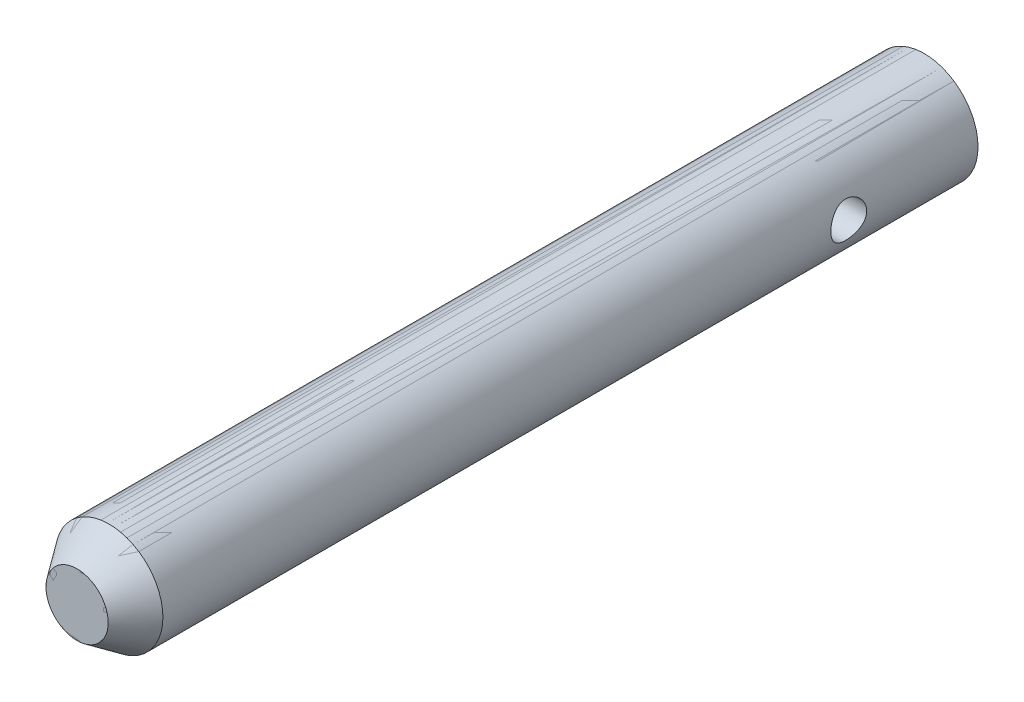
ISO-10303-21;
HEADER;
FILE_DESCRIPTION(('STEP AP214'),'2;1');
FILE_NAME('part.step','',(''),(''),'','','');
FILE_SCHEMA(('AUTOMOTIVE_DESIGN { 1 0 10303 214 1 1 1 1 }'));
ENDSEC;
DATA;
#1=APPLICATION_CONTEXT('core data for automotive mechanical design processes');
#2=APPLICATION_PROTOCOL_DEFINITION('international standard','automotive_design',2000,#1);
#3=PRODUCT_CONTEXT('',#1,'mechanical');
#4=PRODUCT('Part','Part','',(#3));
#5=PRODUCT_RELATED_PRODUCT_CATEGORY('part','',(#4));
#6=PRODUCT_DEFINITION_FORMATION('','',#4);
#7=PRODUCT_DEFINITION_CONTEXT('part definition',#1,'design');
#8=PRODUCT_DEFINITION('design','',#6,#7);
#9=PRODUCT_DEFINITION_SHAPE('','',#8);
#10=(LENGTH_UNIT() NAMED_UNIT(*) SI_UNIT(.MILLI.,.METRE.));
#11=(NAMED_UNIT(*) PLANE_ANGLE_UNIT() SI_UNIT($,.RADIAN.));
#12=(NAMED_UNIT(*) SI_UNIT($,.STERADIAN.) SOLID_ANGLE_UNIT());
#13=UNCERTAINTY_MEASURE_WITH_UNIT(LENGTH_MEASURE(1.E-05),#10,'distance_accuracy_value','');
#14=(GEOMETRIC_REPRESENTATION_CONTEXT(3) GLOBAL_UNCERTAINTY_ASSIGNED_CONTEXT((#13)) GLOBAL_UNIT_ASSIGNED_CONTEXT((#10,
#11,#12)) REPRESENTATION_CONTEXT('',''));
#15=CARTESIAN_POINT('',(0.,0.,0.));
#16=DIRECTION('',(0.,0.,1.));
#17=DIRECTION('',(1.,0.,0.));
#18=AXIS2_PLACEMENT_3D('',#15,#16,#17);
#19=CARTESIAN_POINT('',(0.,0.,118.));
#20=DIRECTION('',(0.,0.,-1.));
#21=DIRECTION('',(-1.,0.,0.));
#22=AXIS2_PLACEMENT_3D('',#19,#20,#21);
#23=CYLINDRICAL_SURFACE('',#22,7.5);
#24=CARTESIAN_POINT('',(0.,0.,113.540736));
#25=DIRECTION('',(0.,0.,1.));
#26=DIRECTION('',(1.,0.,0.));
#27=AXIS2_PLACEMENT_3D('',#24,#25,#26);
#28=CIRCLE('',#27,7.5);
#29=CARTESIAN_POINT('',(7.5,0.,113.540736));
#30=VERTEX_POINT('',#29);
#31=EDGE_CURVE('P0_E65',#30,#30,#28,.T.);
#32=ORIENTED_EDGE('',*,*,#31,.F.);
#33=EDGE_LOOP('',(#32));
#34=FACE_BOUND('',#33,.T.);
#35=CARTESIAN_POINT('',(0.,0.,0.));
#36=DIRECTION('',(0.,0.,-1.));
#37=DIRECTION('',(1.,0.,0.));
#38=AXIS2_PLACEMENT_3D('',#35,#36,#37);
#39=CIRCLE('',#38,7.5);
#40=CARTESIAN_POINT('',(7.5,0.,0.));
#41=VERTEX_POINT('',#40);
#42=EDGE_CURVE('P0_E10',#41,#41,#39,.T.);
#43=ORIENTED_EDGE('',*,*,#42,.F.);
#44=EDGE_LOOP('',(#43));
#45=FACE_BOUND('',#44,.T.);
#46=CARTESIAN_POINT('',(7.5,0.,20.5));
#47=CARTESIAN_POINT('',(7.5000003825236,-0.136408407216808,20.5000006343291));
#48=CARTESIAN_POINT('',(7.49624423768862,-0.272812986346374,20.488799334682));
#49=CARTESIAN_POINT('',(7.48163025508202,-0.54160440218243,20.444427227957));
#50=CARTESIAN_POINT('',(7.47077168005382,-0.673990820297045,20.4112541401277));
#51=CARTESIAN_POINT('',(7.44313269766107,-0.930831973754439,20.3242018915399));
#52=CARTESIAN_POINT('',(7.42636219327133,-1.05529956471508,20.2703573438518));
#53=CARTESIAN_POINT('',(7.38861114293355,-1.29343734201331,20.1436470679041));
#54=CARTESIAN_POINT('',(7.36762976669445,-1.40710539239677,20.0707775874935));
#55=CARTESIAN_POINT('',(7.32285236107513,-1.62435418755567,19.9054354878531));
#56=CARTESIAN_POINT('',(7.29898891159462,-1.72750925074576,19.8124219143488));
#57=CARTESIAN_POINT('',(7.25150786957804,-1.9170817317552,19.6105821132336));
#58=CARTESIAN_POINT('',(7.22789033226373,-2.00349546372365,19.5017524126787));
#59=CARTESIAN_POINT('',(7.18283331193184,-2.15956235556965,19.2675372120089));
#60=CARTESIAN_POINT('',(7.1614759818922,-2.22866214555258,19.1417656506697));
#61=CARTESIAN_POINT('',(7.12438263546503,-2.3445471846943,18.8795597638536));
#62=CARTESIAN_POINT('',(7.10864490401864,-2.39133924346691,18.7431287070931));
#63=CARTESIAN_POINT('',(7.08528258173443,-2.45968365377291,18.4683169462582));
#64=CARTESIAN_POINT('',(7.07740239424028,-2.48203362067942,18.3301569787773));
#65=CARTESIAN_POINT('',(7.06989141573769,-2.50335280833619,18.0518406146103));
#66=CARTESIAN_POINT('',(7.07025807556825,-2.50232925401179,17.911684848227));
#67=CARTESIAN_POINT('',(7.07897537520451,-2.47754975925855,17.6401584238899));
#68=CARTESIAN_POINT('',(7.08696039668832,-2.45483478291749,17.5086789927025));
#69=CARTESIAN_POINT('',(7.10941644311377,-2.38901540712354,17.2515164509829));
#70=CARTESIAN_POINT('',(7.12388824460269,-2.34590856647967,17.1258340364123));
#71=CARTESIAN_POINT('',(7.15794777828122,-2.23984764515053,16.8814681260213));
#72=CARTESIAN_POINT('',(7.17761414482793,-2.17658512176816,16.7629299363262));
#73=CARTESIAN_POINT('',(7.21981396439316,-2.03222276575785,16.5378227293007));
#74=CARTESIAN_POINT('',(7.24234824476159,-1.95111778091001,16.4312571826665));
#75=CARTESIAN_POINT('',(7.28918322919352,-1.76837333170559,16.2272710045981));
#76=CARTESIAN_POINT('',(7.31351473387107,-1.66588287519078,16.1306182637273));
#77=CARTESIAN_POINT('',(7.36017345967592,-1.44584892492516,15.9556718333415));
#78=CARTESIAN_POINT('',(7.38250048845169,-1.32830398915203,15.8773799045888));
#79=CARTESIAN_POINT('',(7.42292769844484,-1.07986903261567,15.7407592494124));
#80=CARTESIAN_POINT('',(7.44098375020098,-0.948858191040844,15.6826362716482));
#81=CARTESIAN_POINT('',(7.47051417861087,-0.678172708411273,15.5894920651107));
#82=CARTESIAN_POINT('',(7.48199084137198,-0.538501095387385,15.5544628114414));
#83=CARTESIAN_POINT('',(7.49669067678601,-0.260959573823259,15.5098608349441));
#84=CARTESIAN_POINT('',(7.5002500458432,-0.123273999662115,15.4992504770681));
#85=CARTESIAN_POINT('',(7.49972256737068,0.151937674900593,15.5008316839962));
#86=CARTESIAN_POINT('',(7.49563701048405,0.289463798299126,15.5130193999497));
#87=CARTESIAN_POINT('',(7.4805006179276,0.55629966576064,15.5590297693399));
#88=CARTESIAN_POINT('',(7.46965496777981,0.685732017087109,15.5922155151237));
#89=CARTESIAN_POINT('',(7.44229617075175,0.937139896448935,15.6784836111668));
#90=CARTESIAN_POINT('',(7.42578230116688,1.05911447127152,15.7315684986695));
#91=CARTESIAN_POINT('',(7.38822328218224,1.29572074098318,15.857676079602));
#92=CARTESIAN_POINT('',(7.36707036889465,1.41007489804287,15.9311864832079));
#93=CARTESIAN_POINT('',(7.32263134790656,1.62516207533897,16.0954853750337));
#94=CARTESIAN_POINT('',(7.29934458984569,1.72589091948895,16.1862791400794));
#95=CARTESIAN_POINT('',(7.25192119951112,1.91563126951575,16.3874468775165));
#96=CARTESIAN_POINT('',(7.2277940271857,2.00390242311442,16.4985230673171));
#97=CARTESIAN_POINT('',(7.18249933236772,2.16064380580893,16.7344289195272));
#98=CARTESIAN_POINT('',(7.16133183455006,2.22911386982753,16.8592586965852));
#99=CARTESIAN_POINT('',(7.12455979478459,2.34399232604091,17.1191825382247));
#100=CARTESIAN_POINT('',(7.10894401982447,2.39044533041255,17.2542551979219));
#101=CARTESIAN_POINT('',(7.08527080766124,2.45973666689839,17.5309466251103));
#102=CARTESIAN_POINT('',(7.07720996559099,2.48258563738485,17.6725624135109));
#103=CARTESIAN_POINT('',(7.06994647185443,2.50319070619336,17.9504927401023));
#104=CARTESIAN_POINT('',(7.07031000643538,2.502175643271,18.0867058507171));
#105=CARTESIAN_POINT('',(7.07878174559668,2.47810573362173,18.3569126873052));
#106=CARTESIAN_POINT('',(7.08688948923405,2.45505219864646,18.4909065448877));
#107=CARTESIAN_POINT('',(7.1096131076223,2.38842953282336,18.7503391575062));
#108=CARTESIAN_POINT('',(7.12410245056194,2.34525836503879,18.8758920625112));
#109=CARTESIAN_POINT('',(7.15790997046171,2.23994841439937,19.1180685173457));
#110=CARTESIAN_POINT('',(7.17722921908483,2.17780542138452,19.23469007797));
#111=CARTESIAN_POINT('',(7.21957073065115,2.03315173145858,19.4612091748073));
#112=CARTESIAN_POINT('',(7.24271779105342,1.94987060691145,19.570591254746));
#113=CARTESIAN_POINT('',(7.28958390708132,1.76660720783912,19.7742245334605));
#114=CARTESIAN_POINT('',(7.31330312280931,1.6666202111287,19.8684714392202));
#115=CARTESIAN_POINT('',(7.35975076313861,1.44810389230172,20.0428610307229));
#116=CARTESIAN_POINT('',(7.38240454503142,1.32900378374932,20.1223108693775));
#117=CARTESIAN_POINT('',(7.4231497793153,1.07839339351657,20.2599760721266));
#118=CARTESIAN_POINT('',(7.44124239769824,0.94688629533087,20.3181968648051));
#119=CARTESIAN_POINT('',(7.47013787671354,0.681234118002436,20.4093040812217));
#120=CARTESIAN_POINT('',(7.48123031056307,0.547469394191021,20.4432061656584));
#121=CARTESIAN_POINT('',(7.49616017660555,0.275801040025618,20.4885507016928));
#122=CARTESIAN_POINT('',(7.49999961329762,0.137898563921866,20.4999993587413));
#123=CARTESIAN_POINT('',(7.5,0.,20.5));
#124=B_SPLINE_CURVE_WITH_KNOTS('',3,(#46,#47,#48,#49,#50,#51,#52,#53,#54,#55,#56,#57,#58,#59,
#60,#61,#62,#63,#64,#65,#66,#67,#68,#69,#70,#71,#72,#73,#74,#75,#76,#77,#78,#79,#80,#81,#82,#83,
#84,#85,#86,#87,#88,#89,#90,#91,#92,#93,#94,#95,#96,#97,#98,#99,#100,#101,#102,#103,#104,#105,
#106,#107,#108,#109,#110,#111,#112,#113,#114,#115,#116,#117,#118,#119,#120,#121,#122,#123),
.UNSPECIFIED.,.T.,.F.,(4,2,2,2,2,2,2,2,2,2,2,2,2,2,2,2,2,2,2,2,2,2,2,2,2,2,2,2,2,2,2,2,2,2,2,2,
2,2,4),(0.,0.408717765065027,0.817477963168803,1.22555668217568,1.63371594449774,
2.05461710706889,2.47561083218825,2.90870962058677,3.34167611732085,3.76004814354602,
4.17829084968715,4.577420663782,4.97659827138703,5.38220427887826,5.78792756395519,
6.21483264528417,6.64177864916545,7.07296014125893,7.5039917219302,7.91633957937924,
8.32861782910441,8.72895394945533,9.12934113210259,9.54025999609341,9.95130452054727,
10.3810255720188,10.8107502058749,11.2396003456693,11.668257117646,12.0748916516065,
12.4815019837844,12.8803896770104,13.2793659543994,13.6957516672951,14.1122552780945,
14.5449915208775,14.9776170288114,15.3909139593453,15.8040966509535),.UNSPECIFIED.);
#125=CARTESIAN_POINT('',(7.5,0.,20.5));
#126=VERTEX_POINT('',#125);
#127=EDGE_CURVE('P0_E70',#126,#126,#124,.T.);
#128=ORIENTED_EDGE('',*,*,#127,.F.);
#129=EDGE_LOOP('',(#128));
#130=FACE_BOUND('',#129,.T.);
#131=CARTESIAN_POINT('',(-7.5,0.,20.5));
#132=CARTESIAN_POINT('',(-7.5000003825236,-0.136408407216808,20.5000006343291));
#133=CARTESIAN_POINT('',(-7.49624423768862,-0.272812986346374,20.488799334682));
#134=CARTESIAN_POINT('',(-7.48163025508202,-0.54160440218243,20.444427227957));
#135=CARTESIAN_POINT('',(-7.47077168005382,-0.673990820297044,20.4112541401277));
#136=CARTESIAN_POINT('',(-7.44313269766107,-0.930831973754437,20.3242018915399));
#137=CARTESIAN_POINT('',(-7.42636219327133,-1.05529956471508,20.2703573438518));
#138=CARTESIAN_POINT('',(-7.38861114293355,-1.29343734201331,20.1436470679041));
#139=CARTESIAN_POINT('',(-7.36762976669445,-1.40710539239676,20.0707775874935));
#140=CARTESIAN_POINT('',(-7.32285236107513,-1.62435418755566,19.9054354878531));
#141=CARTESIAN_POINT('',(-7.29898891159462,-1.72750925074576,19.8124219143488));
#142=CARTESIAN_POINT('',(-7.25150786957804,-1.9170817317552,19.6105821132336));
#143=CARTESIAN_POINT('',(-7.22789033226373,-2.00349546372365,19.5017524126787));
#144=CARTESIAN_POINT('',(-7.18283331193184,-2.15956235556965,19.2675372120089));
#145=CARTESIAN_POINT('',(-7.1614759818922,-2.22866214555258,19.1417656506697));
#146=CARTESIAN_POINT('',(-7.12438263546503,-2.3445471846943,18.8795597638536));
#147=CARTESIAN_POINT('',(-7.10864490401864,-2.39133924346691,18.7431287070931));
#148=CARTESIAN_POINT('',(-7.08528258173443,-2.45968365377291,18.4683169462582));
#149=CARTESIAN_POINT('',(-7.07740239424028,-2.48203362067943,18.3301569787773));
#150=CARTESIAN_POINT('',(-7.06989141573769,-2.50335280833619,18.0518406146103));
#151=CARTESIAN_POINT('',(-7.07025807556825,-2.50232925401179,17.911684848227));
#152=CARTESIAN_POINT('',(-7.07897537520451,-2.47754975925855,17.6401584238899));
#153=CARTESIAN_POINT('',(-7.08696039668832,-2.45483478291749,17.5086789927025));
#154=CARTESIAN_POINT('',(-7.10941644311377,-2.38901540712354,17.2515164509829));
#155=CARTESIAN_POINT('',(-7.12388824460269,-2.34590856647967,17.1258340364123));
#156=CARTESIAN_POINT('',(-7.15794777828122,-2.23984764515053,16.8814681260213));
#157=CARTESIAN_POINT('',(-7.17761414482793,-2.17658512176816,16.7629299363262));
#158=CARTESIAN_POINT('',(-7.21981396439316,-2.03222276575785,16.5378227293007));
#159=CARTESIAN_POINT('',(-7.24234824476159,-1.95111778091001,16.4312571826665));
#160=CARTESIAN_POINT('',(-7.28918322919352,-1.76837333170559,16.2272710045981));
#161=CARTESIAN_POINT('',(-7.31351473387107,-1.66588287519078,16.1306182637273));
#162=CARTESIAN_POINT('',(-7.36017345967592,-1.44584892492516,15.9556718333415));
#163=CARTESIAN_POINT('',(-7.38250048845169,-1.32830398915203,15.8773799045888));
#164=CARTESIAN_POINT('',(-7.42292769844484,-1.07986903261567,15.7407592494124));
#165=CARTESIAN_POINT('',(-7.44098375020098,-0.948858191040846,15.6826362716482));
#166=CARTESIAN_POINT('',(-7.47051417861087,-0.678172708411276,15.5894920651107));
#167=CARTESIAN_POINT('',(-7.48199084137198,-0.538501095387387,15.5544628114414));
#168=CARTESIAN_POINT('',(-7.49669067678601,-0.260959573823261,15.5098608349441));
#169=CARTESIAN_POINT('',(-7.5002500458432,-0.123273999662118,15.4992504770681));
#170=CARTESIAN_POINT('',(-7.49972256737068,0.15193767490059,15.5008316839962));
#171=CARTESIAN_POINT('',(-7.49563701048405,0.289463798299124,15.5130193999497));
#172=CARTESIAN_POINT('',(-7.4805006179276,0.556299665760638,15.5590297693399));
#173=CARTESIAN_POINT('',(-7.46965496777981,0.685732017087109,15.5922155151237));
#174=CARTESIAN_POINT('',(-7.44229617075175,0.937139896448934,15.6784836111668));
#175=CARTESIAN_POINT('',(-7.42578230116688,1.05911447127152,15.7315684986695));
#176=CARTESIAN_POINT('',(-7.38822328218224,1.29572074098318,15.857676079602));
#177=CARTESIAN_POINT('',(-7.36707036889465,1.41007489804286,15.9311864832079));
#178=CARTESIAN_POINT('',(-7.32263134790656,1.62516207533896,16.0954853750337));
#179=CARTESIAN_POINT('',(-7.29934458984569,1.72589091948894,16.1862791400794));
#180=CARTESIAN_POINT('',(-7.25192119951112,1.91563126951575,16.3874468775165));
#181=CARTESIAN_POINT('',(-7.2277940271857,2.00390242311442,16.4985230673171));
#182=CARTESIAN_POINT('',(-7.18249933236772,2.16064380580893,16.7344289195272));
#183=CARTESIAN_POINT('',(-7.16133183455006,2.22911386982753,16.8592586965852));
#184=CARTESIAN_POINT('',(-7.12455979478459,2.34399232604091,17.1191825382247));
#185=CARTESIAN_POINT('',(-7.10894401982447,2.39044533041255,17.2542551979219));
#186=CARTESIAN_POINT('',(-7.08527080766124,2.45973666689839,17.5309466251103));
#187=CARTESIAN_POINT('',(-7.07720996559099,2.48258563738485,17.6725624135109));
#188=CARTESIAN_POINT('',(-7.06994647185443,2.50319070619336,17.9504927401023));
#189=CARTESIAN_POINT('',(-7.07031000643538,2.502175643271,18.0867058507171));
#190=CARTESIAN_POINT('',(-7.07878174559668,2.47810573362173,18.3569126873052));
#191=CARTESIAN_POINT('',(-7.08688948923404,2.45505219864646,18.4909065448877));
#192=CARTESIAN_POINT('',(-7.10961310762229,2.38842953282336,18.7503391575062));
#193=CARTESIAN_POINT('',(-7.12410245056194,2.34525836503879,18.8758920625112));
#194=CARTESIAN_POINT('',(-7.15790997046171,2.23994841439937,19.1180685173457));
#195=CARTESIAN_POINT('',(-7.17722921908483,2.17780542138452,19.23469007797));
#196=CARTESIAN_POINT('',(-7.21957073065115,2.03315173145858,19.4612091748073));
#197=CARTESIAN_POINT('',(-7.24271779105342,1.94987060691146,19.570591254746));
#198=CARTESIAN_POINT('',(-7.28958390708132,1.76660720783912,19.7742245334605));
#199=CARTESIAN_POINT('',(-7.31330312280931,1.6666202111287,19.8684714392202));
#200=CARTESIAN_POINT('',(-7.35975076313861,1.44810389230172,20.0428610307229));
#201=CARTESIAN_POINT('',(-7.38240454503142,1.32900378374933,20.1223108693775));
#202=CARTESIAN_POINT('',(-7.4231497793153,1.07839339351657,20.2599760721266));
#203=CARTESIAN_POINT('',(-7.44124239769824,0.946886295330872,20.3181968648051));
#204=CARTESIAN_POINT('',(-7.47013787671354,0.681234118002437,20.4093040812217));
#205=CARTESIAN_POINT('',(-7.48123031056307,0.547469394191021,20.4432061656584));
#206=CARTESIAN_POINT('',(-7.49616017660555,0.275801040025618,20.4885507016928));
#207=CARTESIAN_POINT('',(-7.49999961329762,0.137898563921866,20.4999993587413));
#208=CARTESIAN_POINT('',(-7.5,0.,20.5));
#209=B_SPLINE_CURVE_WITH_KNOTS('',3,(#131,#132,#133,#134,#135,#136,#137,#138,#139,#140,#141,
#142,#143,#144,#145,#146,#147,#148,#149,#150,#151,#152,#153,#154,#155,#156,#157,#158,#159,#160,
#161,#162,#163,#164,#165,#166,#167,#168,#169,#170,#171,#172,#173,#174,#175,#176,#177,#178,#179,
#180,#181,#182,#183,#184,#185,#186,#187,#188,#189,#190,#191,#192,#193,#194,#195,#196,#197,#198,
#199,#200,#201,#202,#203,#204,#205,#206,#207,#208),.UNSPECIFIED.,.T.,.F.,(4,2,2,2,2,2,2,2,2,2,2,
2,2,2,2,2,2,2,2,2,2,2,2,2,2,2,2,2,2,2,2,2,2,2,2,2,2,2,4),(0.,0.408717765065026,
0.817477963168802,1.22555668217568,1.63371594449773,2.05461710706889,2.47561083218824,
2.90870962058677,3.34167611732085,3.76004814354603,4.17829084968715,4.577420663782,
4.97659827138703,5.38220427887826,5.78792756395519,6.21483264528417,6.64177864916544,
7.07296014125893,7.5039917219302,7.91633957937923,8.32861782910441,8.72895394945533,
9.12934113210259,9.5402599960934,9.95130452054727,10.3810255720188,10.8107502058749,
11.2396003456693,11.668257117646,12.0748916516065,12.4815019837844,12.8803896770104,
13.2793659543994,13.6957516672951,14.1122552780945,14.5449915208775,14.9776170288114,
15.3909139593453,15.8040966509535),.UNSPECIFIED.);
#210=CARTESIAN_POINT('',(-7.5,0.,20.5));
#211=VERTEX_POINT('',#210);
#212=EDGE_CURVE('P0_E78',#211,#211,#209,.T.);
#213=ORIENTED_EDGE('',*,*,#212,.T.);
#214=EDGE_LOOP('',(#213));
#215=FACE_BOUND('',#214,.T.);
#216=ADVANCED_FACE('P0_F52',(#34,#45,#130,#215),#23,.T.);
#217=CARTESIAN_POINT('',(0.,0.,0.));
#218=DIRECTION('',(0.,0.,-1.));
#219=DIRECTION('',(-1.,0.,0.));
#220=AXIS2_PLACEMENT_3D('',#217,#218,#219);
#221=PLANE('',#220);
#222=ORIENTED_EDGE('',*,*,#42,.T.);
#223=EDGE_LOOP('',(#222));
#224=FACE_BOUND('',#223,.T.);
#225=ADVANCED_FACE('P0_F106',(#224),#221,.T.);
#226=CARTESIAN_POINT('',(0.,0.,118.));
#227=DIRECTION('',(0.,0.,-1.));
#228=DIRECTION('',(-1.,0.,0.));
#229=AXIS2_PLACEMENT_3D('',#226,#227,#228);
#230=CONICAL_SURFACE('',#229,4.33433608180037,0.617344235442226);
#231=ORIENTED_EDGE('',*,*,#31,.T.);
#232=EDGE_LOOP('',(#231));
#233=FACE_BOUND('',#232,.T.);
#234=CARTESIAN_POINT('',(0.,0.,118.));
#235=DIRECTION('',(0.,0.,1.));
#236=DIRECTION('',(1.,0.,0.));
#237=AXIS2_PLACEMENT_3D('',#234,#235,#236);
#238=CIRCLE('',#237,4.33433608180037);
#239=CARTESIAN_POINT('',(4.33433608180037,0.,118.));
#240=VERTEX_POINT('',#239);
#241=EDGE_CURVE('P0_E60',#240,#240,#238,.T.);
#242=ORIENTED_EDGE('',*,*,#241,.F.);
#243=EDGE_LOOP('',(#242));
#244=FACE_BOUND('',#243,.T.);
#245=ADVANCED_FACE('P0_F111',(#233,#244),#230,.T.);
#246=CARTESIAN_POINT('',(0.,0.,118.));
#247=DIRECTION('',(0.,0.,-1.));
#248=DIRECTION('',(-1.,0.,0.));
#249=AXIS2_PLACEMENT_3D('',#246,#247,#248);
#250=PLANE('',#249);
#251=CARTESIAN_POINT('',(0.,0.,118.));
#252=DIRECTION('',(0.,0.,-1.));
#253=DIRECTION('',(-1.,0.,0.));
#254=AXIS2_PLACEMENT_3D('',#251,#252,#253);
#255=CIRCLE('',#254,3.54107389630751);
#256=CARTESIAN_POINT('',(-3.54107389630751,0.,118.));
#257=VERTEX_POINT('',#256);
#258=EDGE_CURVE('P0_E55',#257,#257,#255,.F.);
#259=ORIENTED_EDGE('',*,*,#258,.F.);
#260=EDGE_LOOP('',(#259));
#261=FACE_BOUND('',#260,.T.);
#262=ORIENTED_EDGE('',*,*,#241,.T.);
#263=EDGE_LOOP('',(#262));
#264=FACE_BOUND('',#263,.T.);
#265=ADVANCED_FACE('P0_F91',(#261,#264),#250,.F.);
#266=CARTESIAN_POINT('',(119.891617722008,0.,18.));
#267=DIRECTION('',(-1.,0.,0.));
#268=DIRECTION('',(0.,0.,1.));
#269=AXIS2_PLACEMENT_3D('',#266,#267,#268);
#270=CYLINDRICAL_SURFACE('',#269,2.5);
#271=ORIENTED_EDGE('',*,*,#127,.T.);
#272=EDGE_LOOP('',(#271));
#273=FACE_BOUND('',#272,.T.);
#274=ORIENTED_EDGE('',*,*,#212,.F.);
#275=EDGE_LOOP('',(#274));
#276=FACE_BOUND('',#275,.T.);
#277=ADVANCED_FACE('P0_F87',(#273,#276),#270,.F.);
#278=CARTESIAN_POINT('',(0.,0.,119.));
#279=DIRECTION('',(0.,0.,-1.));
#280=DIRECTION('',(-1.,0.,0.));
#281=AXIS2_PLACEMENT_3D('',#278,#279,#280);
#282=CYLINDRICAL_SURFACE('',#281,3.54107389630751);
#283=CARTESIAN_POINT('',(0.,0.,42.9999999999999));
#284=DIRECTION('',(0.,0.,1.));
#285=DIRECTION('',(1.,0.,0.));
#286=AXIS2_PLACEMENT_3D('',#283,#284,#285);
#287=CIRCLE('',#286,3.54107389630751);
#288=CARTESIAN_POINT('',(3.54107389630751,0.,42.9999999999999));
#289=VERTEX_POINT('',#288);
#290=EDGE_CURVE('P0_E121',#289,#289,#287,.T.);
#291=ORIENTED_EDGE('',*,*,#290,.F.);
#292=EDGE_LOOP('',(#291));
#293=FACE_BOUND('',#292,.T.);
#294=ORIENTED_EDGE('',*,*,#258,.T.);
#295=EDGE_LOOP('',(#294));
#296=FACE_BOUND('',#295,.T.);
#297=ADVANCED_FACE('P0_F90',(#293,#296),#282,.F.);
#298=CARTESIAN_POINT('',(0.,0.,42.9999999999999));
#299=DIRECTION('',(0.,0.,1.));
#300=DIRECTION('',(1.,0.,0.));
#301=AXIS2_PLACEMENT_3D('',#298,#299,#300);
#302=PLANE('',#301);
#303=ORIENTED_EDGE('',*,*,#290,.T.);
#304=EDGE_LOOP('',(#303));
#305=FACE_BOUND('',#304,.T.);
#306=ADVANCED_FACE('P0_F98',(#305),#302,.T.);
#307=CLOSED_SHELL('',(#216,#225,#245,#265,#277,#297,#306));
#308=MANIFOLD_SOLID_BREP('P0_B2',#307);
#309=CARTESIAN_POINT('',(0.,0.,118.));
#310=DIRECTION('',(0.,0.,-1.));
#311=DIRECTION('',(-1.,0.,0.));
#312=AXIS2_PLACEMENT_3D('',#309,#310,#311);
#313=CYLINDRICAL_SURFACE('',#312,7.5);
#314=CARTESIAN_POINT('',(0.,0.,113.540736));
#315=DIRECTION('',(0.,0.,1.));
#316=DIRECTION('',(1.,0.,0.));
#317=AXIS2_PLACEMENT_3D('',#314,#315,#316);
#318=CIRCLE('',#317,7.5);
#319=CARTESIAN_POINT('',(7.5,0.,113.540736));
#320=VERTEX_POINT('',#319);
#321=EDGE_CURVE('P1_E27',#320,#320,#318,.T.);
#322=ORIENTED_EDGE('',*,*,#321,.F.);
#323=EDGE_LOOP('',(#322));
#324=FACE_BOUND('',#323,.T.);
#325=CARTESIAN_POINT('',(0.,0.,0.));
#326=DIRECTION('',(0.,0.,-1.));
#327=DIRECTION('',(1.,0.,0.));
#328=AXIS2_PLACEMENT_3D('',#325,#326,#327);
#329=CIRCLE('',#328,7.5);
#330=CARTESIAN_POINT('',(7.5,0.,0.));
#331=VERTEX_POINT('',#330);
#332=EDGE_CURVE('P1_E10',#331,#331,#329,.T.);
#333=ORIENTED_EDGE('',*,*,#332,.F.);
#334=EDGE_LOOP('',(#333));
#335=FACE_BOUND('',#334,.T.);
#336=CARTESIAN_POINT('',(7.5,0.,20.5));
#337=CARTESIAN_POINT('',(7.5000003825236,-0.136408407216808,20.5000006343291));
#338=CARTESIAN_POINT('',(7.49624423768862,-0.272812986346374,20.488799334682));
#339=CARTESIAN_POINT('',(7.48163025508202,-0.54160440218243,20.444427227957));
#340=CARTESIAN_POINT('',(7.47077168005382,-0.673990820297045,20.4112541401277));
#341=CARTESIAN_POINT('',(7.44313269766107,-0.930831973754439,20.3242018915399));
#342=CARTESIAN_POINT('',(7.42636219327133,-1.05529956471508,20.2703573438518));
#343=CARTESIAN_POINT('',(7.38861114293355,-1.29343734201331,20.1436470679041));
#344=CARTESIAN_POINT('',(7.36762976669445,-1.40710539239677,20.0707775874935));
#345=CARTESIAN_POINT('',(7.32285236107513,-1.62435418755567,19.9054354878531));
#346=CARTESIAN_POINT('',(7.29898891159462,-1.72750925074576,19.8124219143488));
#347=CARTESIAN_POINT('',(7.25150786957804,-1.9170817317552,19.6105821132336));
#348=CARTESIAN_POINT('',(7.22789033226373,-2.00349546372365,19.5017524126787));
#349=CARTESIAN_POINT('',(7.18283331193184,-2.15956235556965,19.2675372120089));
#350=CARTESIAN_POINT('',(7.1614759818922,-2.22866214555258,19.1417656506697));
#351=CARTESIAN_POINT('',(7.12438263546503,-2.3445471846943,18.8795597638536));
#352=CARTESIAN_POINT('',(7.10864490401864,-2.39133924346691,18.7431287070931));
#353=CARTESIAN_POINT('',(7.08528258173443,-2.45968365377291,18.4683169462582));
#354=CARTESIAN_POINT('',(7.07740239424028,-2.48203362067942,18.3301569787773));
#355=CARTESIAN_POINT('',(7.06989141573769,-2.50335280833619,18.0518406146103));
#356=CARTESIAN_POINT('',(7.07025807556825,-2.50232925401179,17.911684848227));
#357=CARTESIAN_POINT('',(7.07897537520451,-2.47754975925855,17.6401584238899));
#358=CARTESIAN_POINT('',(7.08696039668832,-2.45483478291749,17.5086789927025));
#359=CARTESIAN_POINT('',(7.10941644311377,-2.38901540712354,17.2515164509829));
#360=CARTESIAN_POINT('',(7.12388824460269,-2.34590856647967,17.1258340364123));
#361=CARTESIAN_POINT('',(7.15794777828122,-2.23984764515053,16.8814681260213));
#362=CARTESIAN_POINT('',(7.17761414482793,-2.17658512176816,16.7629299363262));
#363=CARTESIAN_POINT('',(7.21981396439316,-2.03222276575785,16.5378227293007));
#364=CARTESIAN_POINT('',(7.24234824476159,-1.95111778091001,16.4312571826665));
#365=CARTESIAN_POINT('',(7.28918322919352,-1.76837333170559,16.2272710045981));
#366=CARTESIAN_POINT('',(7.31351473387107,-1.66588287519078,16.1306182637273));
#367=CARTESIAN_POINT('',(7.36017345967592,-1.44584892492516,15.9556718333415));
#368=CARTESIAN_POINT('',(7.38250048845169,-1.32830398915203,15.8773799045888));
#369=CARTESIAN_POINT('',(7.42292769844484,-1.07986903261567,15.7407592494124));
#370=CARTESIAN_POINT('',(7.44098375020098,-0.948858191040844,15.6826362716482));
#371=CARTESIAN_POINT('',(7.47051417861087,-0.678172708411273,15.5894920651107));
#372=CARTESIAN_POINT('',(7.48199084137198,-0.538501095387385,15.5544628114414));
#373=CARTESIAN_POINT('',(7.49669067678601,-0.260959573823259,15.5098608349441));
#374=CARTESIAN_POINT('',(7.5002500458432,-0.123273999662115,15.4992504770681));
#375=CARTESIAN_POINT('',(7.49972256737068,0.151937674900593,15.5008316839962));
#376=CARTESIAN_POINT('',(7.49563701048405,0.289463798299126,15.5130193999497));
#377=CARTESIAN_POINT('',(7.4805006179276,0.55629966576064,15.5590297693399));
#378=CARTESIAN_POINT('',(7.46965496777981,0.685732017087109,15.5922155151237));
#379=CARTESIAN_POINT('',(7.44229617075175,0.937139896448935,15.6784836111668));
#380=CARTESIAN_POINT('',(7.42578230116688,1.05911447127152,15.7315684986695));
#381=CARTESIAN_POINT('',(7.38822328218224,1.29572074098318,15.857676079602));
#382=CARTESIAN_POINT('',(7.36707036889465,1.41007489804287,15.9311864832079));
#383=CARTESIAN_POINT('',(7.32263134790656,1.62516207533897,16.0954853750337));
#384=CARTESIAN_POINT('',(7.29934458984569,1.72589091948895,16.1862791400794));
#385=CARTESIAN_POINT('',(7.25192119951112,1.91563126951575,16.3874468775165));
#386=CARTESIAN_POINT('',(7.2277940271857,2.00390242311442,16.4985230673171));
#387=CARTESIAN_POINT('',(7.18249933236772,2.16064380580893,16.7344289195272));
#388=CARTESIAN_POINT('',(7.16133183455006,2.22911386982753,16.8592586965852));
#389=CARTESIAN_POINT('',(7.12455979478459,2.34399232604091,17.1191825382247));
#390=CARTESIAN_POINT('',(7.10894401982447,2.39044533041255,17.2542551979219));
#391=CARTESIAN_POINT('',(7.08527080766124,2.45973666689839,17.5309466251103));
#392=CARTESIAN_POINT('',(7.07720996559099,2.48258563738485,17.6725624135109));
#393=CARTESIAN_POINT('',(7.06994647185443,2.50319070619336,17.9504927401023));
#394=CARTESIAN_POINT('',(7.07031000643538,2.502175643271,18.0867058507171));
#395=CARTESIAN_POINT('',(7.07878174559668,2.47810573362173,18.3569126873052));
#396=CARTESIAN_POINT('',(7.08688948923405,2.45505219864646,18.4909065448877));
#397=CARTESIAN_POINT('',(7.1096131076223,2.38842953282336,18.7503391575062));
#398=CARTESIAN_POINT('',(7.12410245056194,2.34525836503879,18.8758920625112));
#399=CARTESIAN_POINT('',(7.15790997046171,2.23994841439937,19.1180685173457));
#400=CARTESIAN_POINT('',(7.17722921908483,2.17780542138452,19.23469007797));
#401=CARTESIAN_POINT('',(7.21957073065115,2.03315173145858,19.4612091748073));
#402=CARTESIAN_POINT('',(7.24271779105342,1.94987060691145,19.570591254746));
#403=CARTESIAN_POINT('',(7.28958390708132,1.76660720783912,19.7742245334605));
#404=CARTESIAN_POINT('',(7.31330312280931,1.6666202111287,19.8684714392202));
#405=CARTESIAN_POINT('',(7.35975076313861,1.44810389230172,20.0428610307229));
#406=CARTESIAN_POINT('',(7.38240454503142,1.32900378374932,20.1223108693775));
#407=CARTESIAN_POINT('',(7.4231497793153,1.07839339351657,20.2599760721266));
#408=CARTESIAN_POINT('',(7.44124239769824,0.94688629533087,20.3181968648051));
#409=CARTESIAN_POINT('',(7.47013787671354,0.681234118002436,20.4093040812217));
#410=CARTESIAN_POINT('',(7.48123031056307,0.547469394191021,20.4432061656584));
#411=CARTESIAN_POINT('',(7.49616017660555,0.275801040025618,20.4885507016928));
#412=CARTESIAN_POINT('',(7.49999961329762,0.137898563921866,20.4999993587413));
#413=CARTESIAN_POINT('',(7.5,0.,20.5));
#414=B_SPLINE_CURVE_WITH_KNOTS('',3,(#336,#337,#338,#339,#340,#341,#342,#343,#344,#345,#346,
#347,#348,#349,#350,#351,#352,#353,#354,#355,#356,#357,#358,#359,#360,#361,#362,#363,#364,#365,
#366,#367,#368,#369,#370,#371,#372,#373,#374,#375,#376,#377,#378,#379,#380,#381,#382,#383,#384,
#385,#386,#387,#388,#389,#390,#391,#392,#393,#394,#395,#396,#397,#398,#399,#400,#401,#402,#403,
#404,#405,#406,#407,#408,#409,#410,#411,#412,#413),.UNSPECIFIED.,.T.,.F.,(4,2,2,2,2,2,2,2,2,2,2,
2,2,2,2,2,2,2,2,2,2,2,2,2,2,2,2,2,2,2,2,2,2,2,2,2,2,2,4),(0.,0.408717765065027,
0.817477963168803,1.22555668217568,1.63371594449774,2.05461710706889,2.47561083218825,
2.90870962058677,3.34167611732085,3.76004814354602,4.17829084968715,4.577420663782,
4.97659827138703,5.38220427887826,5.78792756395519,6.21483264528417,6.64177864916545,
7.07296014125893,7.5039917219302,7.91633957937924,8.32861782910441,8.72895394945533,
9.12934113210259,9.54025999609341,9.95130452054727,10.3810255720188,10.8107502058749,
11.2396003456693,11.668257117646,12.0748916516065,12.4815019837844,12.8803896770104,
13.2793659543994,13.6957516672951,14.1122552780945,14.5449915208775,14.9776170288114,
15.3909139593453,15.8040966509535),.UNSPECIFIED.);
#415=CARTESIAN_POINT('',(7.5,0.,20.5));
#416=VERTEX_POINT('',#415);
#417=EDGE_CURVE('P1_E31',#416,#416,#414,.T.);
#418=ORIENTED_EDGE('',*,*,#417,.F.);
#419=EDGE_LOOP('',(#418));
#420=FACE_BOUND('',#419,.T.);
#421=CARTESIAN_POINT('',(-7.5,0.,20.5));
#422=CARTESIAN_POINT('',(-7.5000003825236,-0.136408407216808,20.5000006343291));
#423=CARTESIAN_POINT('',(-7.49624423768862,-0.272812986346374,20.488799334682));
#424=CARTESIAN_POINT('',(-7.48163025508202,-0.54160440218243,20.444427227957));
#425=CARTESIAN_POINT('',(-7.47077168005382,-0.673990820297044,20.4112541401277));
#426=CARTESIAN_POINT('',(-7.44313269766107,-0.930831973754437,20.3242018915399));
#427=CARTESIAN_POINT('',(-7.42636219327133,-1.05529956471508,20.2703573438518));
#428=CARTESIAN_POINT('',(-7.38861114293355,-1.29343734201331,20.1436470679041));
#429=CARTESIAN_POINT('',(-7.36762976669445,-1.40710539239676,20.0707775874935));
#430=CARTESIAN_POINT('',(-7.32285236107513,-1.62435418755566,19.9054354878531));
#431=CARTESIAN_POINT('',(-7.29898891159462,-1.72750925074576,19.8124219143488));
#432=CARTESIAN_POINT('',(-7.25150786957804,-1.9170817317552,19.6105821132336));
#433=CARTESIAN_POINT('',(-7.22789033226373,-2.00349546372365,19.5017524126787));
#434=CARTESIAN_POINT('',(-7.18283331193184,-2.15956235556965,19.2675372120089));
#435=CARTESIAN_POINT('',(-7.1614759818922,-2.22866214555258,19.1417656506697));
#436=CARTESIAN_POINT('',(-7.12438263546503,-2.3445471846943,18.8795597638536));
#437=CARTESIAN_POINT('',(-7.10864490401864,-2.39133924346691,18.7431287070931));
#438=CARTESIAN_POINT('',(-7.08528258173443,-2.45968365377291,18.4683169462582));
#439=CARTESIAN_POINT('',(-7.07740239424028,-2.48203362067943,18.3301569787773));
#440=CARTESIAN_POINT('',(-7.06989141573769,-2.50335280833619,18.0518406146103));
#441=CARTESIAN_POINT('',(-7.07025807556825,-2.50232925401179,17.911684848227));
#442=CARTESIAN_POINT('',(-7.07897537520451,-2.47754975925855,17.6401584238899));
#443=CARTESIAN_POINT('',(-7.08696039668832,-2.45483478291749,17.5086789927025));
#444=CARTESIAN_POINT('',(-7.10941644311377,-2.38901540712354,17.2515164509829));
#445=CARTESIAN_POINT('',(-7.12388824460269,-2.34590856647967,17.1258340364123));
#446=CARTESIAN_POINT('',(-7.15794777828122,-2.23984764515053,16.8814681260213));
#447=CARTESIAN_POINT('',(-7.17761414482793,-2.17658512176816,16.7629299363262));
#448=CARTESIAN_POINT('',(-7.21981396439316,-2.03222276575785,16.5378227293007));
#449=CARTESIAN_POINT('',(-7.24234824476159,-1.95111778091001,16.4312571826665));
#450=CARTESIAN_POINT('',(-7.28918322919352,-1.76837333170559,16.2272710045981));
#451=CARTESIAN_POINT('',(-7.31351473387107,-1.66588287519078,16.1306182637273));
#452=CARTESIAN_POINT('',(-7.36017345967592,-1.44584892492516,15.9556718333415));
#453=CARTESIAN_POINT('',(-7.38250048845169,-1.32830398915203,15.8773799045888));
#454=CARTESIAN_POINT('',(-7.42292769844484,-1.07986903261567,15.7407592494124));
#455=CARTESIAN_POINT('',(-7.44098375020098,-0.948858191040846,15.6826362716482));
#456=CARTESIAN_POINT('',(-7.47051417861087,-0.678172708411276,15.5894920651107));
#457=CARTESIAN_POINT('',(-7.48199084137198,-0.538501095387387,15.5544628114414));
#458=CARTESIAN_POINT('',(-7.49669067678601,-0.260959573823261,15.5098608349441));
#459=CARTESIAN_POINT('',(-7.5002500458432,-0.123273999662118,15.4992504770681));
#460=CARTESIAN_POINT('',(-7.49972256737068,0.15193767490059,15.5008316839962));
#461=CARTESIAN_POINT('',(-7.49563701048405,0.289463798299124,15.5130193999497));
#462=CARTESIAN_POINT('',(-7.4805006179276,0.556299665760638,15.5590297693399));
#463=CARTESIAN_POINT('',(-7.46965496777981,0.685732017087109,15.5922155151237));
#464=CARTESIAN_POINT('',(-7.44229617075175,0.937139896448934,15.6784836111668));
#465=CARTESIAN_POINT('',(-7.42578230116688,1.05911447127152,15.7315684986695));
#466=CARTESIAN_POINT('',(-7.38822328218224,1.29572074098318,15.857676079602));
#467=CARTESIAN_POINT('',(-7.36707036889465,1.41007489804286,15.9311864832079));
#468=CARTESIAN_POINT('',(-7.32263134790656,1.62516207533896,16.0954853750337));
#469=CARTESIAN_POINT('',(-7.29934458984569,1.72589091948894,16.1862791400794));
#470=CARTESIAN_POINT('',(-7.25192119951112,1.91563126951575,16.3874468775165));
#471=CARTESIAN_POINT('',(-7.2277940271857,2.00390242311442,16.4985230673171));
#472=CARTESIAN_POINT('',(-7.18249933236772,2.16064380580893,16.7344289195272));
#473=CARTESIAN_POINT('',(-7.16133183455006,2.22911386982753,16.8592586965852));
#474=CARTESIAN_POINT('',(-7.12455979478459,2.34399232604091,17.1191825382247));
#475=CARTESIAN_POINT('',(-7.10894401982447,2.39044533041255,17.2542551979219));
#476=CARTESIAN_POINT('',(-7.08527080766124,2.45973666689839,17.5309466251103));
#477=CARTESIAN_POINT('',(-7.07720996559099,2.48258563738485,17.6725624135109));
#478=CARTESIAN_POINT('',(-7.06994647185443,2.50319070619336,17.9504927401023));
#479=CARTESIAN_POINT('',(-7.07031000643538,2.502175643271,18.0867058507171));
#480=CARTESIAN_POINT('',(-7.07878174559668,2.47810573362173,18.3569126873052));
#481=CARTESIAN_POINT('',(-7.08688948923404,2.45505219864646,18.4909065448877));
#482=CARTESIAN_POINT('',(-7.10961310762229,2.38842953282336,18.7503391575062));
#483=CARTESIAN_POINT('',(-7.12410245056194,2.34525836503879,18.8758920625112));
#484=CARTESIAN_POINT('',(-7.15790997046171,2.23994841439937,19.1180685173457));
#485=CARTESIAN_POINT('',(-7.17722921908483,2.17780542138452,19.23469007797));
#486=CARTESIAN_POINT('',(-7.21957073065115,2.03315173145858,19.4612091748073));
#487=CARTESIAN_POINT('',(-7.24271779105342,1.94987060691146,19.570591254746));
#488=CARTESIAN_POINT('',(-7.28958390708132,1.76660720783912,19.7742245334605));
#489=CARTESIAN_POINT('',(-7.31330312280931,1.6666202111287,19.8684714392202));
#490=CARTESIAN_POINT('',(-7.35975076313861,1.44810389230172,20.0428610307229));
#491=CARTESIAN_POINT('',(-7.38240454503142,1.32900378374933,20.1223108693775));
#492=CARTESIAN_POINT('',(-7.4231497793153,1.07839339351657,20.2599760721266));
#493=CARTESIAN_POINT('',(-7.44124239769824,0.946886295330872,20.3181968648051));
#494=CARTESIAN_POINT('',(-7.47013787671354,0.681234118002437,20.4093040812217));
#495=CARTESIAN_POINT('',(-7.48123031056307,0.547469394191021,20.4432061656584));
#496=CARTESIAN_POINT('',(-7.49616017660555,0.275801040025618,20.4885507016928));
#497=CARTESIAN_POINT('',(-7.49999961329762,0.137898563921866,20.4999993587413));
#498=CARTESIAN_POINT('',(-7.5,0.,20.5));
#499=B_SPLINE_CURVE_WITH_KNOTS('',3,(#421,#422,#423,#424,#425,#426,#427,#428,#429,#430,#431,
#432,#433,#434,#435,#436,#437,#438,#439,#440,#441,#442,#443,#444,#445,#446,#447,#448,#449,#450,
#451,#452,#453,#454,#455,#456,#457,#458,#459,#460,#461,#462,#463,#464,#465,#466,#467,#468,#469,
#470,#471,#472,#473,#474,#475,#476,#477,#478,#479,#480,#481,#482,#483,#484,#485,#486,#487,#488,
#489,#490,#491,#492,#493,#494,#495,#496,#497,#498),.UNSPECIFIED.,.T.,.F.,(4,2,2,2,2,2,2,2,2,2,2,
2,2,2,2,2,2,2,2,2,2,2,2,2,2,2,2,2,2,2,2,2,2,2,2,2,2,2,4),(0.,0.408717765065026,
0.817477963168802,1.22555668217568,1.63371594449773,2.05461710706889,2.47561083218824,
2.90870962058677,3.34167611732085,3.76004814354603,4.17829084968715,4.577420663782,
4.97659827138703,5.38220427887826,5.78792756395519,6.21483264528417,6.64177864916544,
7.07296014125893,7.5039917219302,7.91633957937923,8.32861782910441,8.72895394945533,
9.12934113210259,9.5402599960934,9.95130452054727,10.3810255720188,10.8107502058749,
11.2396003456693,11.668257117646,12.0748916516065,12.4815019837844,12.8803896770104,
13.2793659543994,13.6957516672951,14.1122552780945,14.5449915208775,14.9776170288114,
15.3909139593453,15.8040966509535),.UNSPECIFIED.);
#500=CARTESIAN_POINT('',(-7.5,0.,20.5));
#501=VERTEX_POINT('',#500);
#502=EDGE_CURVE('P1_E41',#501,#501,#499,.T.);
#503=ORIENTED_EDGE('',*,*,#502,.T.);
#504=EDGE_LOOP('',(#503));
#505=FACE_BOUND('',#504,.T.);
#506=ADVANCED_FACE('P1_F14',(#324,#335,#420,#505),#313,.T.);
#507=CARTESIAN_POINT('',(0.,0.,0.));
#508=DIRECTION('',(0.,0.,-1.));
#509=DIRECTION('',(-1.,0.,0.));
#510=AXIS2_PLACEMENT_3D('',#507,#508,#509);
#511=PLANE('',#510);
#512=ORIENTED_EDGE('',*,*,#332,.T.);
#513=EDGE_LOOP('',(#512));
#514=FACE_BOUND('',#513,.T.);
#515=ADVANCED_FACE('P1_F64',(#514),#511,.T.);
#516=CARTESIAN_POINT('',(0.,0.,118.));
#517=DIRECTION('',(0.,0.,-1.));
#518=DIRECTION('',(-1.,0.,0.));
#519=AXIS2_PLACEMENT_3D('',#516,#517,#518);
#520=CONICAL_SURFACE('',#519,4.33433608180037,0.617344235442226);
#521=ORIENTED_EDGE('',*,*,#321,.T.);
#522=EDGE_LOOP('',(#521));
#523=FACE_BOUND('',#522,.T.);
#524=CARTESIAN_POINT('',(0.,0.,118.));
#525=DIRECTION('',(0.,0.,1.));
#526=DIRECTION('',(1.,0.,0.));
#527=AXIS2_PLACEMENT_3D('',#524,#525,#526);
#528=CIRCLE('',#527,4.33433608180037);
#529=CARTESIAN_POINT('',(4.33433608180037,0.,118.));
#530=VERTEX_POINT('',#529);
#531=EDGE_CURVE('P1_E21',#530,#530,#528,.T.);
#532=ORIENTED_EDGE('',*,*,#531,.F.);
#533=EDGE_LOOP('',(#532));
#534=FACE_BOUND('',#533,.T.);
#535=ADVANCED_FACE('P1_F60',(#523,#534),#520,.T.);
#536=CARTESIAN_POINT('',(0.,0.,118.));
#537=DIRECTION('',(0.,0.,-1.));
#538=DIRECTION('',(-1.,0.,0.));
#539=AXIS2_PLACEMENT_3D('',#536,#537,#538);
#540=PLANE('',#539);
#541=ORIENTED_EDGE('',*,*,#531,.T.);
#542=EDGE_LOOP('',(#541));
#543=FACE_BOUND('',#542,.T.);
#544=ADVANCED_FACE('P1_F52',(#543),#540,.F.);
#545=CARTESIAN_POINT('',(119.891617722008,0.,18.));
#546=DIRECTION('',(-1.,0.,0.));
#547=DIRECTION('',(0.,0.,1.));
#548=AXIS2_PLACEMENT_3D('',#545,#546,#547);
#549=CYLINDRICAL_SURFACE('',#548,2.5);
#550=ORIENTED_EDGE('',*,*,#417,.T.);
#551=EDGE_LOOP('',(#550));
#552=FACE_BOUND('',#551,.T.);
#553=ORIENTED_EDGE('',*,*,#502,.F.);
#554=EDGE_LOOP('',(#553));
#555=FACE_BOUND('',#554,.T.);
#556=ADVANCED_FACE('P1_F49',(#552,#555),#549,.F.);
#557=CLOSED_SHELL('',(#506,#515,#535,#544,#556));
#558=MANIFOLD_SOLID_BREP('P1_B1',#557);
#559=ADVANCED_BREP_SHAPE_REPRESENTATION('',(#18,#308,#558),#14);
#560=SHAPE_DEFINITION_REPRESENTATION(#9,#559);
ENDSEC;
END-ISO-10303-21;
